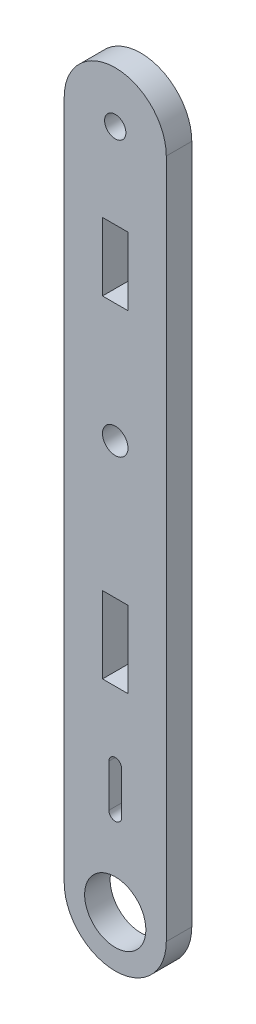
ISO-10303-21;
HEADER;
FILE_DESCRIPTION(('STEP AP214'),'2;1');
FILE_NAME('part.step','',(''),(''),'','','');
FILE_SCHEMA(('AUTOMOTIVE_DESIGN { 1 0 10303 214 1 1 1 1 }'));
ENDSEC;
DATA;
#1=APPLICATION_CONTEXT('core data for automotive mechanical design processes');
#2=APPLICATION_PROTOCOL_DEFINITION('international standard','automotive_design',2000,#1);
#3=PRODUCT_CONTEXT('',#1,'mechanical');
#4=PRODUCT('Part','Part','',(#3));
#5=PRODUCT_RELATED_PRODUCT_CATEGORY('part','',(#4));
#6=PRODUCT_DEFINITION_FORMATION('','',#4);
#7=PRODUCT_DEFINITION_CONTEXT('part definition',#1,'design');
#8=PRODUCT_DEFINITION('design','',#6,#7);
#9=PRODUCT_DEFINITION_SHAPE('','',#8);
#10=(LENGTH_UNIT() NAMED_UNIT(*) SI_UNIT(.MILLI.,.METRE.));
#11=(NAMED_UNIT(*) PLANE_ANGLE_UNIT() SI_UNIT($,.RADIAN.));
#12=(NAMED_UNIT(*) SI_UNIT($,.STERADIAN.) SOLID_ANGLE_UNIT());
#13=UNCERTAINTY_MEASURE_WITH_UNIT(LENGTH_MEASURE(1.E-05),#10,'distance_accuracy_value','');
#14=(GEOMETRIC_REPRESENTATION_CONTEXT(3) GLOBAL_UNCERTAINTY_ASSIGNED_CONTEXT((#13)) GLOBAL_UNIT_ASSIGNED_CONTEXT((#10,
#11,#12)) REPRESENTATION_CONTEXT('',''));
#15=CARTESIAN_POINT('',(0.,0.,0.));
#16=DIRECTION('',(0.,0.,1.));
#17=DIRECTION('',(1.,0.,0.));
#18=AXIS2_PLACEMENT_3D('',#15,#16,#17);
#19=CARTESIAN_POINT('',(2164.74034545616,1500.40001687742,3.));
#20=DIRECTION('',(0.,0.,1.));
#21=DIRECTION('',(1.,0.,0.));
#22=AXIS2_PLACEMENT_3D('',#19,#20,#21);
#23=PLANE('',#22);
#24=CARTESIAN_POINT('',(2164.74034545783,1548.40006445281,3.));
#25=DIRECTION('',(0.,0.,1.));
#26=DIRECTION('',(1.,0.,0.));
#27=AXIS2_PLACEMENT_3D('',#24,#25,#26);
#28=CIRCLE('',#27,1.50000000166674);
#29=CARTESIAN_POINT('',(2166.24034545949,1548.40006445281,3.));
#30=VERTEX_POINT('',#29);
#31=EDGE_CURVE('E224',#30,#30,#28,.T.);
#32=ORIENTED_EDGE('',*,*,#31,.F.);
#33=EDGE_LOOP('',(#32));
#34=FACE_BOUND('',#33,.T.);
#35=DIRECTION('',(0.,-1.,0.));
#36=VECTOR('',#35,1.);
#37=CARTESIAN_POINT('',(2163.24034545616,1523.39996445448,3.));
#38=LINE('',#37,#36);
#39=CARTESIAN_POINT('',(2163.24034545616,1532.39996445448,3.));
#40=VERTEX_POINT('',#39);
#41=CARTESIAN_POINT('',(2163.24034545616,1523.39996445448,3.));
#42=VERTEX_POINT('',#41);
#43=EDGE_CURVE('E238',#40,#42,#38,.T.);
#44=ORIENTED_EDGE('',*,*,#43,.F.);
#45=DIRECTION('',(-1.,0.,0.));
#46=VECTOR('',#45,1.);
#47=CARTESIAN_POINT('',(2163.24034545616,1532.39996445448,3.));
#48=LINE('',#47,#46);
#49=CARTESIAN_POINT('',(2166.24034545616,1532.39996445448,3.));
#50=VERTEX_POINT('',#49);
#51=EDGE_CURVE('E236',#50,#40,#48,.T.);
#52=ORIENTED_EDGE('',*,*,#51,.F.);
#53=DIRECTION('',(0.,1.,0.));
#54=VECTOR('',#53,1.);
#55=CARTESIAN_POINT('',(2166.24034545616,1532.39996445448,3.));
#56=LINE('',#55,#54);
#57=CARTESIAN_POINT('',(2166.24034545616,1523.39996445448,3.));
#58=VERTEX_POINT('',#57);
#59=EDGE_CURVE('E244',#58,#50,#56,.T.);
#60=ORIENTED_EDGE('',*,*,#59,.F.);
#61=DIRECTION('',(1.,0.,0.));
#62=VECTOR('',#61,1.);
#63=CARTESIAN_POINT('',(2166.24034545616,1523.39996445448,3.));
#64=LINE('',#63,#62);
#65=EDGE_CURVE('E241',#42,#58,#64,.T.);
#66=ORIENTED_EDGE('',*,*,#65,.F.);
#67=EDGE_LOOP('',(#44,#52,#60,#66));
#68=FACE_BOUND('',#67,.T.);
#69=CARTESIAN_POINT('',(2164.74034545616,1500.40001687742,3.));
#70=DIRECTION('',(0.,0.,1.));
#71=DIRECTION('',(1.,0.,0.));
#72=AXIS2_PLACEMENT_3D('',#69,#70,#71);
#73=CIRCLE('',#72,6.00000000022924);
#74=CARTESIAN_POINT('',(2158.74034545616,1500.39996445446,3.));
#75=VERTEX_POINT('',#74);
#76=CARTESIAN_POINT('',(2170.74034545616,1500.3999644544,3.));
#77=VERTEX_POINT('',#76);
#78=EDGE_CURVE('E267',#75,#77,#73,.T.);
#79=ORIENTED_EDGE('',*,*,#78,.T.);
#80=DIRECTION('',(0.,1.,0.));
#81=VECTOR('',#80,1.);
#82=CARTESIAN_POINT('',(2170.74034545616,1500.3999644544,3.));
#83=LINE('',#82,#81);
#84=CARTESIAN_POINT('',(2170.74034545616,1580.39996445411,3.));
#85=VERTEX_POINT('',#84);
#86=EDGE_CURVE('E270',#77,#85,#83,.T.);
#87=ORIENTED_EDGE('',*,*,#86,.T.);
#88=CARTESIAN_POINT('',(2164.74034545617,1580.40001445427,3.));
#89=DIRECTION('',(0.,0.,1.));
#90=DIRECTION('',(1.,0.,0.));
#91=AXIS2_PLACEMENT_3D('',#88,#89,#90);
#92=CIRCLE('',#91,6.00000000020543);
#93=CARTESIAN_POINT('',(2158.74034545616,1580.40006445443,3.));
#94=VERTEX_POINT('',#93);
#95=EDGE_CURVE('E273',#85,#94,#92,.T.);
#96=ORIENTED_EDGE('',*,*,#95,.T.);
#97=DIRECTION('',(0.,-1.,0.));
#98=VECTOR('',#97,1.);
#99=CARTESIAN_POINT('',(2158.74034545616,1580.40006445443,3.));
#100=LINE('',#99,#98);
#101=EDGE_CURVE('E275',#94,#75,#100,.T.);
#102=ORIENTED_EDGE('',*,*,#101,.T.);
#103=EDGE_LOOP('',(#79,#87,#96,#102));
#104=FACE_BOUND('',#103,.T.);
#105=CARTESIAN_POINT('',(2164.74034545424,1580.39996445255,3.));
#106=DIRECTION('',(0.,0.,1.));
#107=DIRECTION('',(1.,0.,0.));
#108=AXIS2_PLACEMENT_3D('',#105,#106,#107);
#109=CIRCLE('',#108,1.25000000000008);
#110=CARTESIAN_POINT('',(2165.99034545424,1580.39996445255,3.));
#111=VERTEX_POINT('',#110);
#112=EDGE_CURVE('E230',#111,#111,#109,.T.);
#113=ORIENTED_EDGE('',*,*,#112,.F.);
#114=EDGE_LOOP('',(#113));
#115=FACE_BOUND('',#114,.T.);
#116=CARTESIAN_POINT('',(2164.74034545549,1500.39996445381,3.));
#117=DIRECTION('',(0.,0.,1.));
#118=DIRECTION('',(1.,0.,0.));
#119=AXIS2_PLACEMENT_3D('',#116,#117,#118);
#120=CIRCLE('',#119,3.60000000000003);
#121=CARTESIAN_POINT('',(2168.34034545549,1500.39996445381,3.));
#122=VERTEX_POINT('',#121);
#123=EDGE_CURVE('E218',#122,#122,#120,.T.);
#124=ORIENTED_EDGE('',*,*,#123,.F.);
#125=EDGE_LOOP('',(#124));
#126=FACE_BOUND('',#125,.T.);
#127=DIRECTION('',(0.,-1.,0.));
#128=VECTOR('',#127,1.);
#129=CARTESIAN_POINT('',(2163.24034545616,1570.39996445448,3.));
#130=LINE('',#129,#128);
#131=CARTESIAN_POINT('',(2163.24034545616,1570.39996445448,3.));
#132=VERTEX_POINT('',#131);
#133=CARTESIAN_POINT('',(2163.24034545616,1562.39996445448,3.));
#134=VERTEX_POINT('',#133);
#135=EDGE_CURVE('E189',#132,#134,#130,.T.);
#136=ORIENTED_EDGE('',*,*,#135,.F.);
#137=DIRECTION('',(-1.,0.,0.));
#138=VECTOR('',#137,1.);
#139=CARTESIAN_POINT('',(2166.24034545616,1570.39996445448,3.));
#140=LINE('',#139,#138);
#141=CARTESIAN_POINT('',(2166.24034545616,1570.39996445448,3.));
#142=VERTEX_POINT('',#141);
#143=EDGE_CURVE('E187',#142,#132,#140,.T.);
#144=ORIENTED_EDGE('',*,*,#143,.F.);
#145=DIRECTION('',(0.,1.,0.));
#146=VECTOR('',#145,1.);
#147=CARTESIAN_POINT('',(2166.24034545616,1562.39996445448,3.));
#148=LINE('',#147,#146);
#149=CARTESIAN_POINT('',(2166.24034545616,1562.39996445448,3.));
#150=VERTEX_POINT('',#149);
#151=EDGE_CURVE('E195',#150,#142,#148,.T.);
#152=ORIENTED_EDGE('',*,*,#151,.F.);
#153=DIRECTION('',(1.,0.,0.));
#154=VECTOR('',#153,1.);
#155=CARTESIAN_POINT('',(2163.24034545616,1562.39996445448,3.));
#156=LINE('',#155,#154);
#157=EDGE_CURVE('E192',#134,#150,#156,.T.);
#158=ORIENTED_EDGE('',*,*,#157,.F.);
#159=EDGE_LOOP('',(#136,#144,#152,#158));
#160=FACE_BOUND('',#159,.T.);
#161=DIRECTION('',(-5.07327900262178E-10,1.,0.));
#162=VECTOR('',#161,1.);
#163=CARTESIAN_POINT('',(2165.49034545592,1510.3999682651,3.));
#164=LINE('',#163,#162);
#165=CARTESIAN_POINT('',(2165.49034545592,1510.3999682651,3.));
#166=VERTEX_POINT('',#165);
#167=CARTESIAN_POINT('',(2165.49034545338,1515.3999644517,3.));
#168=VERTEX_POINT('',#167);
#169=EDGE_CURVE('E159',#166,#168,#164,.T.);
#170=ORIENTED_EDGE('',*,*,#169,.F.);
#171=CARTESIAN_POINT('',(2164.74034545616,1510.39998731822,3.));
#172=DIRECTION('',(0.,0.,1.));
#173=DIRECTION('',(1.,0.,0.));
#174=AXIS2_PLACEMENT_3D('',#171,#172,#173);
#175=CIRCLE('',#174,0.750000000000014);
#176=CARTESIAN_POINT('',(2163.9903454564,1510.3999682651,3.));
#177=VERTEX_POINT('',#176);
#178=EDGE_CURVE('E151',#177,#166,#175,.T.);
#179=ORIENTED_EDGE('',*,*,#178,.F.);
#180=DIRECTION('',(-3.21870740122689E-10,-1.,0.));
#181=VECTOR('',#180,1.);
#182=CARTESIAN_POINT('',(2163.99034545801,1515.40004778735,3.));
#183=LINE('',#182,#181);
#184=CARTESIAN_POINT('',(2163.99034545801,1515.40004778735,3.));
#185=VERTEX_POINT('',#184);
#186=EDGE_CURVE('E173',#185,#177,#183,.T.);
#187=ORIENTED_EDGE('',*,*,#186,.F.);
#188=CARTESIAN_POINT('',(2164.74034545338,1515.3999644517,3.));
#189=DIRECTION('',(0.,0.,1.));
#190=DIRECTION('',(1.,0.,0.));
#191=AXIS2_PLACEMENT_3D('',#188,#189,#190);
#192=CIRCLE('',#191,0.749999999999935);
#193=EDGE_CURVE('E171',#168,#185,#192,.T.);
#194=ORIENTED_EDGE('',*,*,#193,.F.);
#195=EDGE_LOOP('',(#170,#179,#187,#194));
#196=FACE_BOUND('',#195,.T.);
#197=ADVANCED_FACE('F38',(#34,#68,#104,#115,#126,#160,#196),#23,.T.);
#198=CARTESIAN_POINT('',(2164.74034545616,1500.40001687742,0.));
#199=DIRECTION('',(0.,0.,1.));
#200=DIRECTION('',(1.,0.,0.));
#201=AXIS2_PLACEMENT_3D('',#198,#199,#200);
#202=PLANE('',#201);
#203=DIRECTION('',(-1.,0.,0.));
#204=VECTOR('',#203,1.);
#205=CARTESIAN_POINT('',(2166.24034545616,1570.39996445448,0.));
#206=LINE('',#205,#204);
#207=CARTESIAN_POINT('',(2166.24034545616,1570.39996445448,0.));
#208=VERTEX_POINT('',#207);
#209=CARTESIAN_POINT('',(2163.24034545616,1570.39996445448,0.));
#210=VERTEX_POINT('',#209);
#211=EDGE_CURVE('E167',#208,#210,#206,.T.);
#212=ORIENTED_EDGE('',*,*,#211,.T.);
#213=DIRECTION('',(0.,-1.,0.));
#214=VECTOR('',#213,1.);
#215=CARTESIAN_POINT('',(2163.24034545616,1570.39996445448,0.));
#216=LINE('',#215,#214);
#217=CARTESIAN_POINT('',(2163.24034545616,1562.39996445448,0.));
#218=VERTEX_POINT('',#217);
#219=EDGE_CURVE('E200',#210,#218,#216,.T.);
#220=ORIENTED_EDGE('',*,*,#219,.T.);
#221=DIRECTION('',(1.,0.,0.));
#222=VECTOR('',#221,1.);
#223=CARTESIAN_POINT('',(2163.24034545616,1562.39996445448,0.));
#224=LINE('',#223,#222);
#225=CARTESIAN_POINT('',(2166.24034545616,1562.39996445448,0.));
#226=VERTEX_POINT('',#225);
#227=EDGE_CURVE('E203',#218,#226,#224,.T.);
#228=ORIENTED_EDGE('',*,*,#227,.T.);
#229=DIRECTION('',(0.,1.,0.));
#230=VECTOR('',#229,1.);
#231=CARTESIAN_POINT('',(2166.24034545616,1562.39996445448,0.));
#232=LINE('',#231,#230);
#233=EDGE_CURVE('E190',#226,#208,#232,.T.);
#234=ORIENTED_EDGE('',*,*,#233,.T.);
#235=EDGE_LOOP('',(#212,#220,#228,#234));
#236=FACE_BOUND('',#235,.T.);
#237=CARTESIAN_POINT('',(2164.74034545616,1500.40001687742,0.));
#238=DIRECTION('',(0.,0.,1.));
#239=DIRECTION('',(1.,0.,0.));
#240=AXIS2_PLACEMENT_3D('',#237,#238,#239);
#241=CIRCLE('',#240,6.00000000022924);
#242=CARTESIAN_POINT('',(2158.74034545616,1500.39996445446,0.));
#243=VERTEX_POINT('',#242);
#244=CARTESIAN_POINT('',(2170.74034545616,1500.3999644544,0.));
#245=VERTEX_POINT('',#244);
#246=EDGE_CURVE('E266',#243,#245,#241,.T.);
#247=ORIENTED_EDGE('',*,*,#246,.F.);
#248=DIRECTION('',(0.,-1.,0.));
#249=VECTOR('',#248,1.);
#250=CARTESIAN_POINT('',(2158.74034545616,1580.40006445443,0.));
#251=LINE('',#250,#249);
#252=CARTESIAN_POINT('',(2158.74034545616,1580.40006445443,0.));
#253=VERTEX_POINT('',#252);
#254=EDGE_CURVE('E271',#253,#243,#251,.T.);
#255=ORIENTED_EDGE('',*,*,#254,.F.);
#256=CARTESIAN_POINT('',(2164.74034545617,1580.40001445427,0.));
#257=DIRECTION('',(0.,0.,1.));
#258=DIRECTION('',(1.,0.,0.));
#259=AXIS2_PLACEMENT_3D('',#256,#257,#258);
#260=CIRCLE('',#259,6.00000000021071);
#261=CARTESIAN_POINT('',(2170.74034545616,1580.39996445411,0.));
#262=VERTEX_POINT('',#261);
#263=EDGE_CURVE('E283',#262,#253,#260,.T.);
#264=ORIENTED_EDGE('',*,*,#263,.F.);
#265=DIRECTION('',(2.4435309676046E-13,1.,0.));
#266=VECTOR('',#265,1.);
#267=CARTESIAN_POINT('',(2170.74034545616,1569.49551800172,0.));
#268=LINE('',#267,#266);
#269=EDGE_CURVE('E280',#245,#262,#268,.T.);
#270=ORIENTED_EDGE('',*,*,#269,.F.);
#271=EDGE_LOOP('',(#247,#255,#264,#270));
#272=FACE_BOUND('',#271,.T.);
#273=DIRECTION('',(-1.,0.,0.));
#274=VECTOR('',#273,1.);
#275=CARTESIAN_POINT('',(2163.24034545616,1532.39996445448,0.));
#276=LINE('',#275,#274);
#277=CARTESIAN_POINT('',(2166.24034545616,1532.39996445448,0.));
#278=VERTEX_POINT('',#277);
#279=CARTESIAN_POINT('',(2163.24034545616,1532.39996445448,0.));
#280=VERTEX_POINT('',#279);
#281=EDGE_CURVE('E233',#278,#280,#276,.T.);
#282=ORIENTED_EDGE('',*,*,#281,.T.);
#283=DIRECTION('',(0.,-1.,0.));
#284=VECTOR('',#283,1.);
#285=CARTESIAN_POINT('',(2163.24034545616,1523.39996445448,0.));
#286=LINE('',#285,#284);
#287=CARTESIAN_POINT('',(2163.24034545616,1523.39996445448,0.));
#288=VERTEX_POINT('',#287);
#289=EDGE_CURVE('E249',#280,#288,#286,.T.);
#290=ORIENTED_EDGE('',*,*,#289,.T.);
#291=DIRECTION('',(1.,0.,0.));
#292=VECTOR('',#291,1.);
#293=CARTESIAN_POINT('',(2166.24034545616,1523.39996445448,0.));
#294=LINE('',#293,#292);
#295=CARTESIAN_POINT('',(2166.24034545616,1523.39996445448,0.));
#296=VERTEX_POINT('',#295);
#297=EDGE_CURVE('E252',#288,#296,#294,.T.);
#298=ORIENTED_EDGE('',*,*,#297,.T.);
#299=DIRECTION('',(0.,1.,0.));
#300=VECTOR('',#299,1.);
#301=CARTESIAN_POINT('',(2166.24034545616,1532.39996445448,0.));
#302=LINE('',#301,#300);
#303=EDGE_CURVE('E239',#296,#278,#302,.T.);
#304=ORIENTED_EDGE('',*,*,#303,.T.);
#305=EDGE_LOOP('',(#282,#290,#298,#304));
#306=FACE_BOUND('',#305,.T.);
#307=CARTESIAN_POINT('',(2164.74034545424,1580.39996445255,0.));
#308=DIRECTION('',(0.,0.,1.));
#309=DIRECTION('',(1.,0.,0.));
#310=AXIS2_PLACEMENT_3D('',#307,#308,#309);
#311=CIRCLE('',#310,1.25000000000008);
#312=CARTESIAN_POINT('',(2165.99034545424,1580.39996445255,0.));
#313=VERTEX_POINT('',#312);
#314=EDGE_CURVE('E227',#313,#313,#311,.T.);
#315=ORIENTED_EDGE('',*,*,#314,.T.);
#316=EDGE_LOOP('',(#315));
#317=FACE_BOUND('',#316,.T.);
#318=CARTESIAN_POINT('',(2164.74034545783,1548.40006445281,0.));
#319=DIRECTION('',(0.,0.,1.));
#320=DIRECTION('',(1.,0.,0.));
#321=AXIS2_PLACEMENT_3D('',#318,#319,#320);
#322=CIRCLE('',#321,1.50000000166674);
#323=CARTESIAN_POINT('',(2166.24034545949,1548.40006445281,0.));
#324=VERTEX_POINT('',#323);
#325=EDGE_CURVE('E221',#324,#324,#322,.T.);
#326=ORIENTED_EDGE('',*,*,#325,.T.);
#327=EDGE_LOOP('',(#326));
#328=FACE_BOUND('',#327,.T.);
#329=CARTESIAN_POINT('',(2164.74034545549,1500.39996445381,0.));
#330=DIRECTION('',(0.,0.,1.));
#331=DIRECTION('',(1.,0.,0.));
#332=AXIS2_PLACEMENT_3D('',#329,#330,#331);
#333=CIRCLE('',#332,3.60000000000003);
#334=CARTESIAN_POINT('',(2168.34034545549,1500.39996445381,0.));
#335=VERTEX_POINT('',#334);
#336=EDGE_CURVE('E217',#335,#335,#333,.T.);
#337=ORIENTED_EDGE('',*,*,#336,.T.);
#338=EDGE_LOOP('',(#337));
#339=FACE_BOUND('',#338,.T.);
#340=CARTESIAN_POINT('',(2164.74034545616,1510.39998731822,0.));
#341=DIRECTION('',(0.,0.,1.));
#342=DIRECTION('',(1.,0.,0.));
#343=AXIS2_PLACEMENT_3D('',#340,#341,#342);
#344=CIRCLE('',#343,0.750000000000014);
#345=CARTESIAN_POINT('',(2163.9903454564,1510.3999682651,0.));
#346=VERTEX_POINT('',#345);
#347=CARTESIAN_POINT('',(2165.49034545592,1510.3999682651,0.));
#348=VERTEX_POINT('',#347);
#349=EDGE_CURVE('E61',#346,#348,#344,.T.);
#350=ORIENTED_EDGE('',*,*,#349,.T.);
#351=DIRECTION('',(-5.07327900262178E-10,1.,0.));
#352=VECTOR('',#351,1.);
#353=CARTESIAN_POINT('',(2165.49034545592,1510.3999682651,0.));
#354=LINE('',#353,#352);
#355=CARTESIAN_POINT('',(2165.49034545338,1515.3999644517,0.));
#356=VERTEX_POINT('',#355);
#357=EDGE_CURVE('E166',#348,#356,#354,.T.);
#358=ORIENTED_EDGE('',*,*,#357,.T.);
#359=CARTESIAN_POINT('',(2164.74034545338,1515.3999644517,0.));
#360=DIRECTION('',(0.,0.,1.));
#361=DIRECTION('',(1.,0.,0.));
#362=AXIS2_PLACEMENT_3D('',#359,#360,#361);
#363=CIRCLE('',#362,0.749999999999935);
#364=CARTESIAN_POINT('',(2163.99034545801,1515.40004778735,0.));
#365=VERTEX_POINT('',#364);
#366=EDGE_CURVE('E179',#356,#365,#363,.T.);
#367=ORIENTED_EDGE('',*,*,#366,.T.);
#368=DIRECTION('',(-3.21870740122689E-10,-1.,0.));
#369=VECTOR('',#368,1.);
#370=CARTESIAN_POINT('',(2163.99034545801,1515.40004778735,0.));
#371=LINE('',#370,#369);
#372=EDGE_CURVE('E160',#365,#346,#371,.T.);
#373=ORIENTED_EDGE('',*,*,#372,.T.);
#374=EDGE_LOOP('',(#350,#358,#367,#373));
#375=FACE_BOUND('',#374,.T.);
#376=ADVANCED_FACE('F301',(#236,#272,#306,#317,#328,#339,#375),#202,.F.);
#377=CARTESIAN_POINT('',(2164.74034545616,1500.40001687742,3.));
#378=DIRECTION('',(0.,0.,-1.));
#379=DIRECTION('',(-1.,0.,0.));
#380=AXIS2_PLACEMENT_3D('',#377,#378,#379);
#381=CYLINDRICAL_SURFACE('',#380,6.00000000022924);
#382=ORIENTED_EDGE('',*,*,#246,.T.);
#383=DIRECTION('',(0.,0.,-1.));
#384=VECTOR('',#383,1.);
#385=CARTESIAN_POINT('',(2170.74034545616,1500.3999644544,3.));
#386=LINE('',#385,#384);
#387=EDGE_CURVE('E11',#77,#245,#386,.T.);
#388=ORIENTED_EDGE('',*,*,#387,.F.);
#389=ORIENTED_EDGE('',*,*,#78,.F.);
#390=DIRECTION('',(0.,0.,-1.));
#391=VECTOR('',#390,1.);
#392=CARTESIAN_POINT('',(2158.74034545616,1500.39996445446,3.));
#393=LINE('',#392,#391);
#394=EDGE_CURVE('E277',#75,#243,#393,.T.);
#395=ORIENTED_EDGE('',*,*,#394,.T.);
#396=EDGE_LOOP('',(#382,#388,#389,#395));
#397=FACE_BOUND('',#396,.T.);
#398=ADVANCED_FACE('F40',(#397),#381,.T.);
#399=CARTESIAN_POINT('',(2170.74034545616,1569.49551800172,3.));
#400=DIRECTION('',(-1.,2.4435309676046E-13,0.));
#401=DIRECTION('',(-2.4435309676046E-13,-1.,0.));
#402=AXIS2_PLACEMENT_3D('',#399,#400,#401);
#403=PLANE('',#402);
#404=ORIENTED_EDGE('',*,*,#269,.T.);
#405=DIRECTION('',(0.,0.,-1.));
#406=VECTOR('',#405,1.);
#407=CARTESIAN_POINT('',(2170.74034545616,1580.39996445411,3.));
#408=LINE('',#407,#406);
#409=EDGE_CURVE('E46',#85,#262,#408,.T.);
#410=ORIENTED_EDGE('',*,*,#409,.F.);
#411=ORIENTED_EDGE('',*,*,#86,.F.);
#412=ORIENTED_EDGE('',*,*,#387,.T.);
#413=EDGE_LOOP('',(#404,#410,#411,#412));
#414=FACE_BOUND('',#413,.T.);
#415=ADVANCED_FACE('F297',(#414),#403,.F.);
#416=CARTESIAN_POINT('',(2164.74034545617,1580.40001445427,3.));
#417=DIRECTION('',(0.,0.,-1.));
#418=DIRECTION('',(-1.,0.,0.));
#419=AXIS2_PLACEMENT_3D('',#416,#417,#418);
#420=CYLINDRICAL_SURFACE('',#419,6.00000000021071);
#421=ORIENTED_EDGE('',*,*,#263,.T.);
#422=DIRECTION('',(0.,0.,-1.));
#423=VECTOR('',#422,1.);
#424=CARTESIAN_POINT('',(2158.74034545616,1580.40006445443,3.));
#425=LINE('',#424,#423);
#426=EDGE_CURVE('E288',#94,#253,#425,.T.);
#427=ORIENTED_EDGE('',*,*,#426,.F.);
#428=ORIENTED_EDGE('',*,*,#95,.F.);
#429=ORIENTED_EDGE('',*,*,#409,.T.);
#430=EDGE_LOOP('',(#421,#427,#428,#429));
#431=FACE_BOUND('',#430,.T.);
#432=ADVANCED_FACE('F294',(#431),#420,.T.);
#433=CARTESIAN_POINT('',(2158.74034545616,1580.40006445443,3.));
#434=DIRECTION('',(1.,0.,0.));
#435=DIRECTION('',(0.,1.,0.));
#436=AXIS2_PLACEMENT_3D('',#433,#434,#435);
#437=PLANE('',#436);
#438=ORIENTED_EDGE('',*,*,#254,.T.);
#439=ORIENTED_EDGE('',*,*,#394,.F.);
#440=ORIENTED_EDGE('',*,*,#101,.F.);
#441=ORIENTED_EDGE('',*,*,#426,.T.);
#442=EDGE_LOOP('',(#438,#439,#440,#441));
#443=FACE_BOUND('',#442,.T.);
#444=ADVANCED_FACE('F306',(#443),#437,.F.);
#445=CARTESIAN_POINT('',(2163.24034545616,1532.39996445448,3.));
#446=DIRECTION('',(0.,-1.,0.));
#447=DIRECTION('',(0.,0.,-1.));
#448=AXIS2_PLACEMENT_3D('',#445,#446,#447);
#449=PLANE('',#448);
#450=ORIENTED_EDGE('',*,*,#281,.F.);
#451=DIRECTION('',(0.,0.,-1.));
#452=VECTOR('',#451,1.);
#453=CARTESIAN_POINT('',(2166.24034545616,1532.39996445448,3.));
#454=LINE('',#453,#452);
#455=EDGE_CURVE('E246',#50,#278,#454,.T.);
#456=ORIENTED_EDGE('',*,*,#455,.F.);
#457=ORIENTED_EDGE('',*,*,#51,.T.);
#458=DIRECTION('',(0.,0.,-1.));
#459=VECTOR('',#458,1.);
#460=CARTESIAN_POINT('',(2163.24034545616,1532.39996445448,3.));
#461=LINE('',#460,#459);
#462=EDGE_CURVE('E263',#40,#280,#461,.T.);
#463=ORIENTED_EDGE('',*,*,#462,.T.);
#464=EDGE_LOOP('',(#450,#456,#457,#463));
#465=FACE_BOUND('',#464,.T.);
#466=ADVANCED_FACE('F374',(#465),#449,.T.);
#467=CARTESIAN_POINT('',(2163.24034545616,1523.39996445448,3.));
#468=DIRECTION('',(1.,0.,0.));
#469=DIRECTION('',(0.,0.,-1.));
#470=AXIS2_PLACEMENT_3D('',#467,#468,#469);
#471=PLANE('',#470);
#472=ORIENTED_EDGE('',*,*,#289,.F.);
#473=ORIENTED_EDGE('',*,*,#462,.F.);
#474=ORIENTED_EDGE('',*,*,#43,.T.);
#475=DIRECTION('',(0.,0.,-1.));
#476=VECTOR('',#475,1.);
#477=CARTESIAN_POINT('',(2163.24034545616,1523.39996445448,3.));
#478=LINE('',#477,#476);
#479=EDGE_CURVE('E261',#42,#288,#478,.T.);
#480=ORIENTED_EDGE('',*,*,#479,.T.);
#481=EDGE_LOOP('',(#472,#473,#474,#480));
#482=FACE_BOUND('',#481,.T.);
#483=ADVANCED_FACE('F370',(#482),#471,.T.);
#484=CARTESIAN_POINT('',(2166.24034545616,1523.39996445448,3.));
#485=DIRECTION('',(0.,1.,0.));
#486=DIRECTION('',(0.,0.,1.));
#487=AXIS2_PLACEMENT_3D('',#484,#485,#486);
#488=PLANE('',#487);
#489=ORIENTED_EDGE('',*,*,#297,.F.);
#490=ORIENTED_EDGE('',*,*,#479,.F.);
#491=ORIENTED_EDGE('',*,*,#65,.T.);
#492=DIRECTION('',(0.,0.,-1.));
#493=VECTOR('',#492,1.);
#494=CARTESIAN_POINT('',(2166.24034545616,1523.39996445448,3.));
#495=LINE('',#494,#493);
#496=EDGE_CURVE('E259',#58,#296,#495,.T.);
#497=ORIENTED_EDGE('',*,*,#496,.T.);
#498=EDGE_LOOP('',(#489,#490,#491,#497));
#499=FACE_BOUND('',#498,.T.);
#500=ADVANCED_FACE('F366',(#499),#488,.T.);
#501=CARTESIAN_POINT('',(2166.24034545616,1532.39996445448,3.));
#502=DIRECTION('',(-1.,0.,0.));
#503=DIRECTION('',(0.,0.,1.));
#504=AXIS2_PLACEMENT_3D('',#501,#502,#503);
#505=PLANE('',#504);
#506=ORIENTED_EDGE('',*,*,#303,.F.);
#507=ORIENTED_EDGE('',*,*,#496,.F.);
#508=ORIENTED_EDGE('',*,*,#59,.T.);
#509=ORIENTED_EDGE('',*,*,#455,.T.);
#510=EDGE_LOOP('',(#506,#507,#508,#509));
#511=FACE_BOUND('',#510,.T.);
#512=ADVANCED_FACE('F362',(#511),#505,.T.);
#513=CARTESIAN_POINT('',(2164.74034545424,1580.39996445255,3.));
#514=DIRECTION('',(0.,0.,-1.));
#515=DIRECTION('',(-1.,0.,0.));
#516=AXIS2_PLACEMENT_3D('',#513,#514,#515);
#517=CYLINDRICAL_SURFACE('',#516,1.25000000000008);
#518=ORIENTED_EDGE('',*,*,#112,.T.);
#519=EDGE_LOOP('',(#518));
#520=FACE_BOUND('',#519,.T.);
#521=ORIENTED_EDGE('',*,*,#314,.F.);
#522=EDGE_LOOP('',(#521));
#523=FACE_BOUND('',#522,.T.);
#524=ADVANCED_FACE('F358',(#520,#523),#517,.F.);
#525=CARTESIAN_POINT('',(2164.74034545783,1548.40006445281,3.));
#526=DIRECTION('',(0.,0.,-1.));
#527=DIRECTION('',(-1.,0.,0.));
#528=AXIS2_PLACEMENT_3D('',#525,#526,#527);
#529=CYLINDRICAL_SURFACE('',#528,1.50000000166674);
#530=ORIENTED_EDGE('',*,*,#31,.T.);
#531=EDGE_LOOP('',(#530));
#532=FACE_BOUND('',#531,.T.);
#533=ORIENTED_EDGE('',*,*,#325,.F.);
#534=EDGE_LOOP('',(#533));
#535=FACE_BOUND('',#534,.T.);
#536=ADVANCED_FACE('F354',(#532,#535),#529,.F.);
#537=CARTESIAN_POINT('',(2164.74034545549,1500.39996445381,3.));
#538=DIRECTION('',(0.,0.,-1.));
#539=DIRECTION('',(-1.,0.,0.));
#540=AXIS2_PLACEMENT_3D('',#537,#538,#539);
#541=CYLINDRICAL_SURFACE('',#540,3.60000000000003);
#542=ORIENTED_EDGE('',*,*,#123,.T.);
#543=EDGE_LOOP('',(#542));
#544=FACE_BOUND('',#543,.T.);
#545=ORIENTED_EDGE('',*,*,#336,.F.);
#546=EDGE_LOOP('',(#545));
#547=FACE_BOUND('',#546,.T.);
#548=ADVANCED_FACE('F351',(#544,#547),#541,.F.);
#549=CARTESIAN_POINT('',(2166.24034545616,1570.39996445448,3.));
#550=DIRECTION('',(0.,-1.,0.));
#551=DIRECTION('',(0.,0.,-1.));
#552=AXIS2_PLACEMENT_3D('',#549,#550,#551);
#553=PLANE('',#552);
#554=ORIENTED_EDGE('',*,*,#211,.F.);
#555=DIRECTION('',(0.,0.,-1.));
#556=VECTOR('',#555,1.);
#557=CARTESIAN_POINT('',(2166.24034545616,1570.39996445448,3.));
#558=LINE('',#557,#556);
#559=EDGE_CURVE('E197',#142,#208,#558,.T.);
#560=ORIENTED_EDGE('',*,*,#559,.F.);
#561=ORIENTED_EDGE('',*,*,#143,.T.);
#562=DIRECTION('',(0.,0.,-1.));
#563=VECTOR('',#562,1.);
#564=CARTESIAN_POINT('',(2163.24034545616,1570.39996445448,3.));
#565=LINE('',#564,#563);
#566=EDGE_CURVE('E214',#132,#210,#565,.T.);
#567=ORIENTED_EDGE('',*,*,#566,.T.);
#568=EDGE_LOOP('',(#554,#560,#561,#567));
#569=FACE_BOUND('',#568,.T.);
#570=ADVANCED_FACE('F333',(#569),#553,.T.);
#571=CARTESIAN_POINT('',(2163.24034545616,1570.39996445448,3.));
#572=DIRECTION('',(1.,0.,0.));
#573=DIRECTION('',(0.,0.,-1.));
#574=AXIS2_PLACEMENT_3D('',#571,#572,#573);
#575=PLANE('',#574);
#576=ORIENTED_EDGE('',*,*,#219,.F.);
#577=ORIENTED_EDGE('',*,*,#566,.F.);
#578=ORIENTED_EDGE('',*,*,#135,.T.);
#579=DIRECTION('',(0.,0.,-1.));
#580=VECTOR('',#579,1.);
#581=CARTESIAN_POINT('',(2163.24034545616,1562.39996445448,3.));
#582=LINE('',#581,#580);
#583=EDGE_CURVE('E212',#134,#218,#582,.T.);
#584=ORIENTED_EDGE('',*,*,#583,.T.);
#585=EDGE_LOOP('',(#576,#577,#578,#584));
#586=FACE_BOUND('',#585,.T.);
#587=ADVANCED_FACE('F326',(#586),#575,.T.);
#588=CARTESIAN_POINT('',(2163.24034545616,1562.39996445448,3.));
#589=DIRECTION('',(0.,1.,0.));
#590=DIRECTION('',(0.,0.,1.));
#591=AXIS2_PLACEMENT_3D('',#588,#589,#590);
#592=PLANE('',#591);
#593=ORIENTED_EDGE('',*,*,#227,.F.);
#594=ORIENTED_EDGE('',*,*,#583,.F.);
#595=ORIENTED_EDGE('',*,*,#157,.T.);
#596=DIRECTION('',(0.,0.,-1.));
#597=VECTOR('',#596,1.);
#598=CARTESIAN_POINT('',(2166.24034545616,1562.39996445448,3.));
#599=LINE('',#598,#597);
#600=EDGE_CURVE('E210',#150,#226,#599,.T.);
#601=ORIENTED_EDGE('',*,*,#600,.T.);
#602=EDGE_LOOP('',(#593,#594,#595,#601));
#603=FACE_BOUND('',#602,.T.);
#604=ADVANCED_FACE('F329',(#603),#592,.T.);
#605=CARTESIAN_POINT('',(2166.24034545616,1562.39996445448,3.));
#606=DIRECTION('',(-1.,0.,0.));
#607=DIRECTION('',(0.,0.,1.));
#608=AXIS2_PLACEMENT_3D('',#605,#606,#607);
#609=PLANE('',#608);
#610=ORIENTED_EDGE('',*,*,#233,.F.);
#611=ORIENTED_EDGE('',*,*,#600,.F.);
#612=ORIENTED_EDGE('',*,*,#151,.T.);
#613=ORIENTED_EDGE('',*,*,#559,.T.);
#614=EDGE_LOOP('',(#610,#611,#612,#613));
#615=FACE_BOUND('',#614,.T.);
#616=ADVANCED_FACE('F336',(#615),#609,.T.);
#617=CARTESIAN_POINT('',(2164.74034545616,1510.39998731822,3.));
#618=DIRECTION('',(0.,0.,-1.));
#619=DIRECTION('',(-1.,0.,0.));
#620=AXIS2_PLACEMENT_3D('',#617,#618,#619);
#621=CYLINDRICAL_SURFACE('',#620,0.750000000000014);
#622=ORIENTED_EDGE('',*,*,#349,.F.);
#623=DIRECTION('',(0.,0.,-1.));
#624=VECTOR('',#623,1.);
#625=CARTESIAN_POINT('',(2163.9903454564,1510.3999682651,3.));
#626=LINE('',#625,#624);
#627=EDGE_CURVE('E155',#177,#346,#626,.T.);
#628=ORIENTED_EDGE('',*,*,#627,.F.);
#629=ORIENTED_EDGE('',*,*,#178,.T.);
#630=DIRECTION('',(0.,0.,-1.));
#631=VECTOR('',#630,1.);
#632=CARTESIAN_POINT('',(2165.49034545592,1510.3999682651,3.));
#633=LINE('',#632,#631);
#634=EDGE_CURVE('E154',#166,#348,#633,.T.);
#635=ORIENTED_EDGE('',*,*,#634,.T.);
#636=EDGE_LOOP('',(#622,#628,#629,#635));
#637=FACE_BOUND('',#636,.T.);
#638=ADVANCED_FACE('F153',(#637),#621,.F.);
#639=CARTESIAN_POINT('',(2165.49034545592,1510.3999682651,3.));
#640=DIRECTION('',(-1.,-5.07327900262178E-10,0.));
#641=DIRECTION('',(5.07327900262178E-10,-1.,0.));
#642=AXIS2_PLACEMENT_3D('',#639,#640,#641);
#643=PLANE('',#642);
#644=ORIENTED_EDGE('',*,*,#357,.F.);
#645=ORIENTED_EDGE('',*,*,#634,.F.);
#646=ORIENTED_EDGE('',*,*,#169,.T.);
#647=DIRECTION('',(0.,0.,-1.));
#648=VECTOR('',#647,1.);
#649=CARTESIAN_POINT('',(2165.49034545338,1515.3999644517,3.));
#650=LINE('',#649,#648);
#651=EDGE_CURVE('E168',#168,#356,#650,.T.);
#652=ORIENTED_EDGE('',*,*,#651,.T.);
#653=EDGE_LOOP('',(#644,#645,#646,#652));
#654=FACE_BOUND('',#653,.T.);
#655=ADVANCED_FACE('F163',(#654),#643,.T.);
#656=CARTESIAN_POINT('',(2164.74034545338,1515.3999644517,3.));
#657=DIRECTION('',(0.,0.,-1.));
#658=DIRECTION('',(-1.,0.,0.));
#659=AXIS2_PLACEMENT_3D('',#656,#657,#658);
#660=CYLINDRICAL_SURFACE('',#659,0.749999999999935);
#661=ORIENTED_EDGE('',*,*,#366,.F.);
#662=ORIENTED_EDGE('',*,*,#651,.F.);
#663=ORIENTED_EDGE('',*,*,#193,.T.);
#664=DIRECTION('',(0.,0.,-1.));
#665=VECTOR('',#664,1.);
#666=CARTESIAN_POINT('',(2163.99034545801,1515.40004778735,3.));
#667=LINE('',#666,#665);
#668=EDGE_CURVE('E53',#185,#365,#667,.T.);
#669=ORIENTED_EDGE('',*,*,#668,.T.);
#670=EDGE_LOOP('',(#661,#662,#663,#669));
#671=FACE_BOUND('',#670,.T.);
#672=ADVANCED_FACE('F509',(#671),#660,.F.);
#673=CARTESIAN_POINT('',(2163.99034545801,1515.40004778735,3.));
#674=DIRECTION('',(1.,-3.21870740122689E-10,0.));
#675=DIRECTION('',(3.21870740122689E-10,1.,0.));
#676=AXIS2_PLACEMENT_3D('',#673,#674,#675);
#677=PLANE('',#676);
#678=ORIENTED_EDGE('',*,*,#372,.F.);
#679=ORIENTED_EDGE('',*,*,#668,.F.);
#680=ORIENTED_EDGE('',*,*,#186,.T.);
#681=ORIENTED_EDGE('',*,*,#627,.T.);
#682=EDGE_LOOP('',(#678,#679,#680,#681));
#683=FACE_BOUND('',#682,.T.);
#684=ADVANCED_FACE('F516',(#683),#677,.T.);
#685=CLOSED_SHELL('',(#197,#376,#398,#415,#432,#444,#466,#483,#500,#512,#524,#536,#548,#570,
#587,#604,#616,#638,#655,#672,#684));
#686=MANIFOLD_SOLID_BREP('B2',#685);
#687=ADVANCED_BREP_SHAPE_REPRESENTATION('',(#18,#686),#14);
#688=SHAPE_DEFINITION_REPRESENTATION(#9,#687);
ENDSEC;
END-ISO-10303-21;
